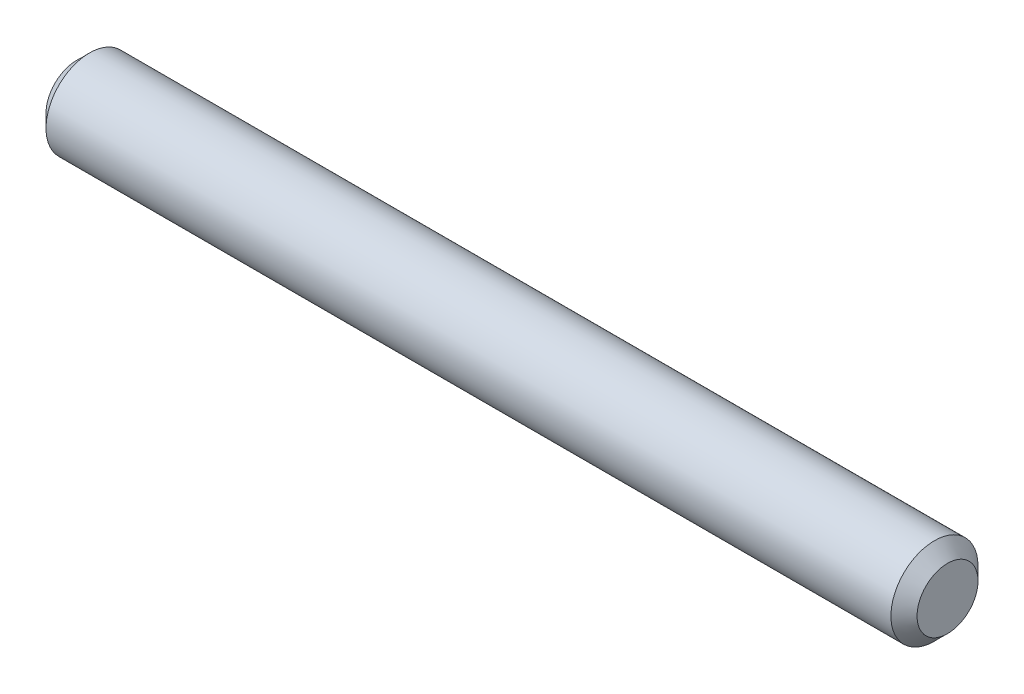
ISO-10303-21;
HEADER;
FILE_DESCRIPTION(('STEP AP214'),'2;1');
FILE_NAME('part.step','',(''),(''),'','','');
FILE_SCHEMA(('AUTOMOTIVE_DESIGN { 1 0 10303 214 1 1 1 1 }'));
ENDSEC;
DATA;
#1=APPLICATION_CONTEXT('core data for automotive mechanical design processes');
#2=APPLICATION_PROTOCOL_DEFINITION('international standard','automotive_design',2000,#1);
#3=PRODUCT_CONTEXT('',#1,'mechanical');
#4=PRODUCT('Part','Part','',(#3));
#5=PRODUCT_RELATED_PRODUCT_CATEGORY('part','',(#4));
#6=PRODUCT_DEFINITION_FORMATION('','',#4);
#7=PRODUCT_DEFINITION_CONTEXT('part definition',#1,'design');
#8=PRODUCT_DEFINITION('design','',#6,#7);
#9=PRODUCT_DEFINITION_SHAPE('','',#8);
#10=(LENGTH_UNIT() NAMED_UNIT(*) SI_UNIT(.MILLI.,.METRE.));
#11=(NAMED_UNIT(*) PLANE_ANGLE_UNIT() SI_UNIT($,.RADIAN.));
#12=(NAMED_UNIT(*) SI_UNIT($,.STERADIAN.) SOLID_ANGLE_UNIT());
#13=UNCERTAINTY_MEASURE_WITH_UNIT(LENGTH_MEASURE(1.E-05),#10,'distance_accuracy_value','');
#14=(GEOMETRIC_REPRESENTATION_CONTEXT(3) GLOBAL_UNCERTAINTY_ASSIGNED_CONTEXT((#13)) GLOBAL_UNIT_ASSIGNED_CONTEXT((#10,
#11,#12)) REPRESENTATION_CONTEXT('',''));
#15=CARTESIAN_POINT('',(0.,0.,0.));
#16=DIRECTION('',(0.,0.,1.));
#17=DIRECTION('',(1.,0.,0.));
#18=AXIS2_PLACEMENT_3D('',#15,#16,#17);
#19=CARTESIAN_POINT('',(-31.75,0.,0.));
#20=DIRECTION('',(1.,0.,0.));
#21=DIRECTION('',(0.,0.,-1.));
#22=AXIS2_PLACEMENT_3D('',#19,#20,#21);
#23=CYLINDRICAL_SURFACE('',#22,3.175);
#24=CARTESIAN_POINT('',(-30.7975,0.,0.));
#25=DIRECTION('',(1.,0.,0.));
#26=DIRECTION('',(0.,0.,-1.));
#27=AXIS2_PLACEMENT_3D('',#24,#25,#26);
#28=CIRCLE('',#27,3.175);
#29=CARTESIAN_POINT('',(-30.7975,0.,-3.175));
#30=VERTEX_POINT('',#29);
#31=EDGE_CURVE('E45',#30,#30,#28,.T.);
#32=ORIENTED_EDGE('',*,*,#31,.T.);
#33=EDGE_LOOP('',(#32));
#34=FACE_BOUND('',#33,.T.);
#35=CARTESIAN_POINT('',(30.7975,0.,0.));
#36=DIRECTION('',(1.,0.,0.));
#37=DIRECTION('',(0.,0.,-1.));
#38=AXIS2_PLACEMENT_3D('',#35,#36,#37);
#39=CIRCLE('',#38,3.175);
#40=CARTESIAN_POINT('',(30.7975,0.,-3.175));
#41=VERTEX_POINT('',#40);
#42=EDGE_CURVE('E49',#41,#41,#39,.F.);
#43=ORIENTED_EDGE('',*,*,#42,.T.);
#44=EDGE_LOOP('',(#43));
#45=FACE_BOUND('',#44,.T.);
#46=ADVANCED_FACE('F34',(#34,#45),#23,.T.);
#47=CARTESIAN_POINT('',(-31.75,0.,0.));
#48=DIRECTION('',(1.,0.,0.));
#49=DIRECTION('',(0.,0.,-1.));
#50=AXIS2_PLACEMENT_3D('',#47,#48,#49);
#51=PLANE('',#50);
#52=CARTESIAN_POINT('',(-31.75,0.,0.));
#53=DIRECTION('',(1.,0.,0.));
#54=DIRECTION('',(0.,0.,-1.));
#55=AXIS2_PLACEMENT_3D('',#52,#53,#54);
#56=CIRCLE('',#55,2.2225);
#57=CARTESIAN_POINT('',(-31.75,0.,-2.2225));
#58=VERTEX_POINT('',#57);
#59=EDGE_CURVE('E41',#58,#58,#56,.F.);
#60=ORIENTED_EDGE('',*,*,#59,.T.);
#61=EDGE_LOOP('',(#60));
#62=FACE_BOUND('',#61,.T.);
#63=ADVANCED_FACE('F65',(#62),#51,.F.);
#64=CARTESIAN_POINT('',(31.75,0.,0.));
#65=DIRECTION('',(1.,0.,0.));
#66=DIRECTION('',(0.,0.,-1.));
#67=AXIS2_PLACEMENT_3D('',#64,#65,#66);
#68=PLANE('',#67);
#69=CARTESIAN_POINT('',(31.75,0.,0.));
#70=DIRECTION('',(1.,0.,0.));
#71=DIRECTION('',(0.,0.,-1.));
#72=AXIS2_PLACEMENT_3D('',#69,#70,#71);
#73=CIRCLE('',#72,2.22249999999999);
#74=CARTESIAN_POINT('',(31.75,0.,-2.22249999999999));
#75=VERTEX_POINT('',#74);
#76=EDGE_CURVE('E10',#75,#75,#73,.T.);
#77=ORIENTED_EDGE('',*,*,#76,.T.);
#78=EDGE_LOOP('',(#77));
#79=FACE_BOUND('',#78,.T.);
#80=ADVANCED_FACE('F62',(#79),#68,.T.);
#81=CARTESIAN_POINT('',(-30.7975,0.,0.));
#82=DIRECTION('',(1.,0.,0.));
#83=DIRECTION('',(0.,0.,-1.));
#84=AXIS2_PLACEMENT_3D('',#81,#82,#83);
#85=CONICAL_SURFACE('',#84,3.175,0.785398163397447);
#86=ORIENTED_EDGE('',*,*,#59,.F.);
#87=EDGE_LOOP('',(#86));
#88=FACE_BOUND('',#87,.T.);
#89=ORIENTED_EDGE('',*,*,#31,.F.);
#90=EDGE_LOOP('',(#89));
#91=FACE_BOUND('',#90,.T.);
#92=ADVANCED_FACE('F58',(#88,#91),#85,.T.);
#93=CARTESIAN_POINT('',(31.75,0.,0.));
#94=DIRECTION('',(-1.,0.,0.));
#95=DIRECTION('',(0.,0.,1.));
#96=AXIS2_PLACEMENT_3D('',#93,#94,#95);
#97=CONICAL_SURFACE('',#96,2.22249999999999,0.78539816339745);
#98=ORIENTED_EDGE('',*,*,#42,.F.);
#99=EDGE_LOOP('',(#98));
#100=FACE_BOUND('',#99,.T.);
#101=ORIENTED_EDGE('',*,*,#76,.F.);
#102=EDGE_LOOP('',(#101));
#103=FACE_BOUND('',#102,.T.);
#104=ADVANCED_FACE('F36',(#100,#103),#97,.T.);
#105=CLOSED_SHELL('',(#46,#63,#80,#92,#104));
#106=MANIFOLD_SOLID_BREP('B2',#105);
#107=ADVANCED_BREP_SHAPE_REPRESENTATION('',(#18,#106),#14);
#108=SHAPE_DEFINITION_REPRESENTATION(#9,#107);
ENDSEC;
END-ISO-10303-21;
